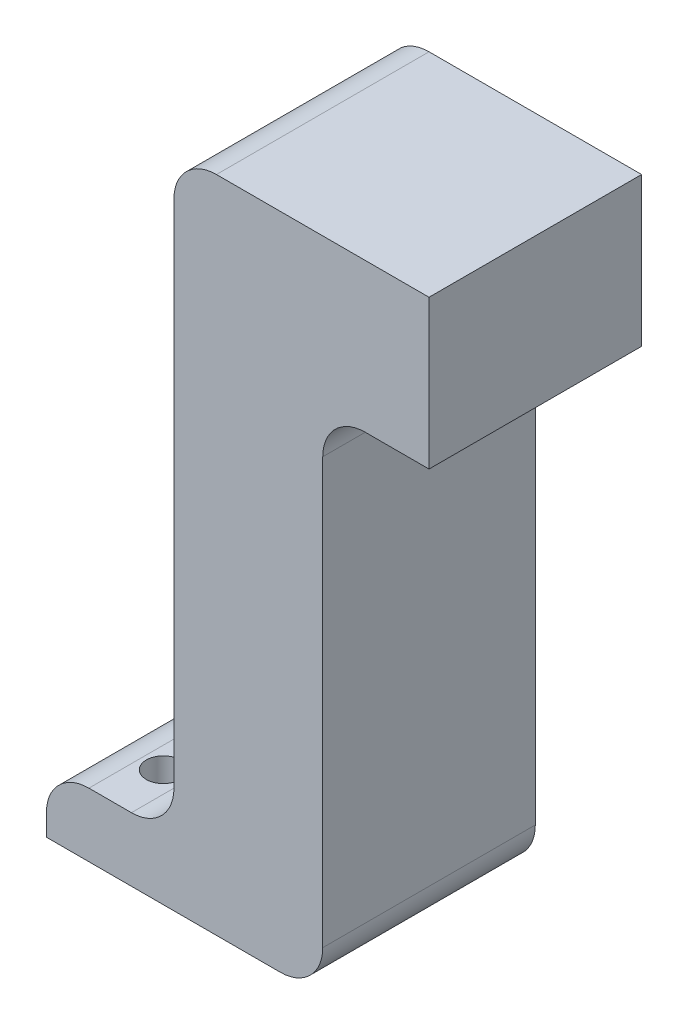
ISO-10303-21;
HEADER;
FILE_DESCRIPTION(('STEP AP214'),'2;1');
FILE_NAME('part.step','',(''),(''),'','','');
FILE_SCHEMA(('AUTOMOTIVE_DESIGN { 1 0 10303 214 1 1 1 1 }'));
ENDSEC;
DATA;
#1=APPLICATION_CONTEXT('core data for automotive mechanical design processes');
#2=APPLICATION_PROTOCOL_DEFINITION('international standard','automotive_design',2000,#1);
#3=PRODUCT_CONTEXT('',#1,'mechanical');
#4=PRODUCT('Part','Part','',(#3));
#5=PRODUCT_RELATED_PRODUCT_CATEGORY('part','',(#4));
#6=PRODUCT_DEFINITION_FORMATION('','',#4);
#7=PRODUCT_DEFINITION_CONTEXT('part definition',#1,'design');
#8=PRODUCT_DEFINITION('design','',#6,#7);
#9=PRODUCT_DEFINITION_SHAPE('','',#8);
#10=(LENGTH_UNIT() NAMED_UNIT(*) SI_UNIT(.MILLI.,.METRE.));
#11=(NAMED_UNIT(*) PLANE_ANGLE_UNIT() SI_UNIT($,.RADIAN.));
#12=(NAMED_UNIT(*) SI_UNIT($,.STERADIAN.) SOLID_ANGLE_UNIT());
#13=UNCERTAINTY_MEASURE_WITH_UNIT(LENGTH_MEASURE(1.E-05),#10,'distance_accuracy_value','');
#14=(GEOMETRIC_REPRESENTATION_CONTEXT(3) GLOBAL_UNCERTAINTY_ASSIGNED_CONTEXT((#13)) GLOBAL_UNIT_ASSIGNED_CONTEXT((#10,
#11,#12)) REPRESENTATION_CONTEXT('',''));
#15=CARTESIAN_POINT('',(0.,0.,0.));
#16=DIRECTION('',(0.,0.,1.));
#17=DIRECTION('',(1.,0.,0.));
#18=AXIS2_PLACEMENT_3D('',#15,#16,#17);
#19=CARTESIAN_POINT('',(0.,2.,-0.625));
#20=DIRECTION('',(0.,-1.,0.));
#21=DIRECTION('',(0.,0.,-1.));
#22=AXIS2_PLACEMENT_3D('',#19,#20,#21);
#23=PLANE('',#22);
#24=DIRECTION('',(1.,0.,0.));
#25=VECTOR('',#24,1.);
#26=CARTESIAN_POINT('',(0.,2.,-0.625));
#27=LINE('',#26,#25);
#28=CARTESIAN_POINT('',(-0.964230564727712,2.,-0.625));
#29=VERTEX_POINT('',#28);
#30=CARTESIAN_POINT('',(1.53576943527229,2.,-0.625));
#31=VERTEX_POINT('',#30);
#32=EDGE_CURVE('E217',#29,#31,#27,.T.);
#33=ORIENTED_EDGE('',*,*,#32,.F.);
#34=DIRECTION('',(0.,0.,1.));
#35=VECTOR('',#34,1.);
#36=CARTESIAN_POINT('',(-0.964230564727712,2.,-0.625));
#37=LINE('',#36,#35);
#38=CARTESIAN_POINT('',(-0.964230564727712,2.,1.875));
#39=VERTEX_POINT('',#38);
#40=EDGE_CURVE('E276',#29,#39,#37,.T.);
#41=ORIENTED_EDGE('',*,*,#40,.T.);
#42=DIRECTION('',(1.,0.,0.));
#43=VECTOR('',#42,1.);
#44=CARTESIAN_POINT('',(0.,2.,1.875));
#45=LINE('',#44,#43);
#46=CARTESIAN_POINT('',(1.53576943527229,2.,1.875));
#47=VERTEX_POINT('',#46);
#48=EDGE_CURVE('E207',#39,#47,#45,.T.);
#49=ORIENTED_EDGE('',*,*,#48,.T.);
#50=DIRECTION('',(0.,0.,1.));
#51=VECTOR('',#50,1.);
#52=CARTESIAN_POINT('',(1.53576943527229,2.,-0.625));
#53=LINE('',#52,#51);
#54=EDGE_CURVE('E201',#31,#47,#53,.T.);
#55=ORIENTED_EDGE('',*,*,#54,.F.);
#56=EDGE_LOOP('',(#33,#41,#49,#55));
#57=FACE_BOUND('',#56,.T.);
#58=ADVANCED_FACE('F83',(#57),#23,.F.);
#59=CARTESIAN_POINT('',(-1.46423056472771,0.,-0.625));
#60=DIRECTION('',(1.,0.,0.));
#61=DIRECTION('',(0.,1.,0.));
#62=AXIS2_PLACEMENT_3D('',#59,#60,#61);
#63=PLANE('',#62);
#64=DIRECTION('',(0.,1.,0.));
#65=VECTOR('',#64,1.);
#66=CARTESIAN_POINT('',(-1.46423056472771,0.,-0.625));
#67=LINE('',#66,#65);
#68=CARTESIAN_POINT('',(-1.46423056472771,-4.5,-0.625));
#69=VERTEX_POINT('',#68);
#70=CARTESIAN_POINT('',(-1.46423056472771,1.5,-0.625));
#71=VERTEX_POINT('',#70);
#72=EDGE_CURVE('E202',#69,#71,#67,.T.);
#73=ORIENTED_EDGE('',*,*,#72,.F.);
#74=DIRECTION('',(0.,0.,1.));
#75=VECTOR('',#74,1.);
#76=CARTESIAN_POINT('',(-1.46423056472771,-4.5,-0.625));
#77=LINE('',#76,#75);
#78=CARTESIAN_POINT('',(-1.46423056472771,-4.5,1.875));
#79=VERTEX_POINT('',#78);
#80=EDGE_CURVE('E271',#69,#79,#77,.T.);
#81=ORIENTED_EDGE('',*,*,#80,.T.);
#82=DIRECTION('',(0.,1.,0.));
#83=VECTOR('',#82,1.);
#84=CARTESIAN_POINT('',(-1.46423056472771,0.,1.875));
#85=LINE('',#84,#83);
#86=CARTESIAN_POINT('',(-1.46423056472771,1.5,1.875));
#87=VERTEX_POINT('',#86);
#88=EDGE_CURVE('E209',#79,#87,#85,.T.);
#89=ORIENTED_EDGE('',*,*,#88,.T.);
#90=DIRECTION('',(0.,0.,1.));
#91=VECTOR('',#90,1.);
#92=CARTESIAN_POINT('',(-1.46423056472771,1.5,-0.625));
#93=LINE('',#92,#91);
#94=EDGE_CURVE('E106',#87,#71,#93,.F.);
#95=ORIENTED_EDGE('',*,*,#94,.T.);
#96=EDGE_LOOP('',(#73,#81,#89,#95));
#97=FACE_BOUND('',#96,.T.);
#98=ADVANCED_FACE('F302',(#97),#63,.F.);
#99=CARTESIAN_POINT('',(1.53576943527229,0.,-0.625));
#100=DIRECTION('',(1.,0.,0.));
#101=DIRECTION('',(0.,0.,-1.));
#102=AXIS2_PLACEMENT_3D('',#99,#100,#101);
#103=PLANE('',#102);
#104=ORIENTED_EDGE('',*,*,#54,.T.);
#105=DIRECTION('',(0.,1.,0.));
#106=VECTOR('',#105,1.);
#107=CARTESIAN_POINT('',(1.53576943527229,0.,1.875));
#108=LINE('',#107,#106);
#109=CARTESIAN_POINT('',(1.53576943527229,0.25,1.875));
#110=VERTEX_POINT('',#109);
#111=EDGE_CURVE('E185',#110,#47,#108,.T.);
#112=ORIENTED_EDGE('',*,*,#111,.F.);
#113=DIRECTION('',(0.,0.,1.));
#114=VECTOR('',#113,1.);
#115=CARTESIAN_POINT('',(1.53576943527229,0.25,-0.625));
#116=LINE('',#115,#114);
#117=CARTESIAN_POINT('',(1.53576943527229,0.25,-0.625));
#118=VERTEX_POINT('',#117);
#119=EDGE_CURVE('E194',#118,#110,#116,.T.);
#120=ORIENTED_EDGE('',*,*,#119,.F.);
#121=DIRECTION('',(0.,1.,0.));
#122=VECTOR('',#121,1.);
#123=CARTESIAN_POINT('',(1.53576943527229,0.,-0.625));
#124=LINE('',#123,#122);
#125=EDGE_CURVE('E215',#118,#31,#124,.T.);
#126=ORIENTED_EDGE('',*,*,#125,.T.);
#127=EDGE_LOOP('',(#104,#112,#120,#126));
#128=FACE_BOUND('',#127,.T.);
#129=ADVANCED_FACE('F205',(#128),#103,.T.);
#130=CARTESIAN_POINT('',(0.,0.,-0.625));
#131=DIRECTION('',(0.,0.,1.));
#132=DIRECTION('',(1.,0.,0.));
#133=AXIS2_PLACEMENT_3D('',#130,#131,#132);
#134=PLANE('',#133);
#135=DIRECTION('',(0.,1.,0.));
#136=VECTOR('',#135,1.);
#137=CARTESIAN_POINT('',(-2.96423056472771,0.,-0.625));
#138=LINE('',#137,#136);
#139=CARTESIAN_POINT('',(-2.96423056472771,-5.75,-0.625));
#140=VERTEX_POINT('',#139);
#141=CARTESIAN_POINT('',(-2.96423056472771,-5.5,-0.625));
#142=VERTEX_POINT('',#141);
#143=EDGE_CURVE('E236',#140,#142,#138,.T.);
#144=ORIENTED_EDGE('',*,*,#143,.T.);
#145=CARTESIAN_POINT('',(-2.46423056472771,-5.5,-0.625));
#146=DIRECTION('',(0.,0.,1.));
#147=DIRECTION('',(1.,0.,0.));
#148=AXIS2_PLACEMENT_3D('',#145,#146,#147);
#149=CIRCLE('',#148,0.5);
#150=CARTESIAN_POINT('',(-2.46423056472771,-5.,-0.625));
#151=VERTEX_POINT('',#150);
#152=EDGE_CURVE('E261',#142,#151,#149,.F.);
#153=ORIENTED_EDGE('',*,*,#152,.T.);
#154=DIRECTION('',(-1.,0.,0.));
#155=VECTOR('',#154,1.);
#156=CARTESIAN_POINT('',(0.,-5.,-0.625));
#157=LINE('',#156,#155);
#158=CARTESIAN_POINT('',(-1.96423056472771,-5.,-0.625));
#159=VERTEX_POINT('',#158);
#160=EDGE_CURVE('E241',#159,#151,#157,.T.);
#161=ORIENTED_EDGE('',*,*,#160,.F.);
#162=CARTESIAN_POINT('',(-1.96423056472771,-4.5,-0.625));
#163=DIRECTION('',(0.,0.,1.));
#164=DIRECTION('',(1.,0.,0.));
#165=AXIS2_PLACEMENT_3D('',#162,#163,#164);
#166=CIRCLE('',#165,0.5);
#167=EDGE_CURVE('E281',#159,#69,#166,.T.);
#168=ORIENTED_EDGE('',*,*,#167,.T.);
#169=ORIENTED_EDGE('',*,*,#72,.T.);
#170=CARTESIAN_POINT('',(-0.964230564727712,1.5,-0.625));
#171=DIRECTION('',(0.,0.,1.));
#172=DIRECTION('',(1.,0.,0.));
#173=AXIS2_PLACEMENT_3D('',#170,#171,#172);
#174=CIRCLE('',#173,0.5);
#175=EDGE_CURVE('E98',#71,#29,#174,.F.);
#176=ORIENTED_EDGE('',*,*,#175,.T.);
#177=ORIENTED_EDGE('',*,*,#32,.T.);
#178=ORIENTED_EDGE('',*,*,#125,.F.);
#179=DIRECTION('',(1.,0.,0.));
#180=VECTOR('',#179,1.);
#181=CARTESIAN_POINT('',(0.,0.25,-0.625));
#182=LINE('',#181,#180);
#183=CARTESIAN_POINT('',(0.785769435272288,0.25,-0.625));
#184=VERTEX_POINT('',#183);
#185=EDGE_CURVE('E197',#184,#118,#182,.T.);
#186=ORIENTED_EDGE('',*,*,#185,.F.);
#187=CARTESIAN_POINT('',(0.785769435272288,-0.25,-0.625));
#188=DIRECTION('',(0.,0.,1.));
#189=DIRECTION('',(1.,0.,0.));
#190=AXIS2_PLACEMENT_3D('',#187,#188,#189);
#191=CIRCLE('',#190,0.5);
#192=CARTESIAN_POINT('',(0.285769435272288,-0.25,-0.625));
#193=VERTEX_POINT('',#192);
#194=EDGE_CURVE('E91',#184,#193,#191,.T.);
#195=ORIENTED_EDGE('',*,*,#194,.T.);
#196=DIRECTION('',(0.,-1.,0.));
#197=VECTOR('',#196,1.);
#198=CARTESIAN_POINT('',(0.285769435272288,0.25,-0.625));
#199=LINE('',#198,#197);
#200=CARTESIAN_POINT('',(0.285769435272291,-5.25,-0.625));
#201=VERTEX_POINT('',#200);
#202=EDGE_CURVE('E222',#193,#201,#199,.T.);
#203=ORIENTED_EDGE('',*,*,#202,.T.);
#204=CARTESIAN_POINT('',(-0.214230564727709,-5.25,-0.625));
#205=DIRECTION('',(0.,0.,1.));
#206=DIRECTION('',(1.,0.,0.));
#207=AXIS2_PLACEMENT_3D('',#204,#205,#206);
#208=CIRCLE('',#207,0.5);
#209=CARTESIAN_POINT('',(-0.214230564727709,-5.75,-0.625));
#210=VERTEX_POINT('',#209);
#211=EDGE_CURVE('E259',#201,#210,#208,.F.);
#212=ORIENTED_EDGE('',*,*,#211,.T.);
#213=DIRECTION('',(-1.,0.,0.));
#214=VECTOR('',#213,1.);
#215=CARTESIAN_POINT('',(0.,-5.75,-0.625));
#216=LINE('',#215,#214);
#217=EDGE_CURVE('E239',#210,#140,#216,.T.);
#218=ORIENTED_EDGE('',*,*,#217,.T.);
#219=EDGE_LOOP('',(#144,#153,#161,#168,#169,#176,#177,#178,#186,#195,#203,#212,#218));
#220=FACE_BOUND('',#219,.T.);
#221=ADVANCED_FACE('F283',(#220),#134,.F.);
#222=CARTESIAN_POINT('',(0.,0.,1.875));
#223=DIRECTION('',(0.,0.,1.));
#224=DIRECTION('',(1.,0.,0.));
#225=AXIS2_PLACEMENT_3D('',#222,#223,#224);
#226=PLANE('',#225);
#227=DIRECTION('',(-1.,0.,0.));
#228=VECTOR('',#227,1.);
#229=CARTESIAN_POINT('',(0.,-5.,1.875));
#230=LINE('',#229,#228);
#231=CARTESIAN_POINT('',(-1.96423056472771,-5.,1.875));
#232=VERTEX_POINT('',#231);
#233=CARTESIAN_POINT('',(-2.46423056472771,-5.,1.875));
#234=VERTEX_POINT('',#233);
#235=EDGE_CURVE('E234',#232,#234,#230,.T.);
#236=ORIENTED_EDGE('',*,*,#235,.T.);
#237=CARTESIAN_POINT('',(-2.46423056472771,-5.5,1.875));
#238=DIRECTION('',(0.,0.,1.));
#239=DIRECTION('',(1.,0.,0.));
#240=AXIS2_PLACEMENT_3D('',#237,#238,#239);
#241=CIRCLE('',#240,0.5);
#242=CARTESIAN_POINT('',(-2.96423056472771,-5.5,1.875));
#243=VERTEX_POINT('',#242);
#244=EDGE_CURVE('E254',#234,#243,#241,.T.);
#245=ORIENTED_EDGE('',*,*,#244,.T.);
#246=DIRECTION('',(0.,1.,0.));
#247=VECTOR('',#246,1.);
#248=CARTESIAN_POINT('',(-2.96423056472771,0.,1.875));
#249=LINE('',#248,#247);
#250=CARTESIAN_POINT('',(-2.96423056472771,-5.75,1.875));
#251=VERTEX_POINT('',#250);
#252=EDGE_CURVE('E229',#251,#243,#249,.T.);
#253=ORIENTED_EDGE('',*,*,#252,.F.);
#254=DIRECTION('',(-1.,0.,0.));
#255=VECTOR('',#254,1.);
#256=CARTESIAN_POINT('',(0.,-5.75,1.875));
#257=LINE('',#256,#255);
#258=CARTESIAN_POINT('',(-0.214230564727709,-5.75,1.875));
#259=VERTEX_POINT('',#258);
#260=EDGE_CURVE('E232',#259,#251,#257,.T.);
#261=ORIENTED_EDGE('',*,*,#260,.F.);
#262=CARTESIAN_POINT('',(-0.214230564727709,-5.25,1.875));
#263=DIRECTION('',(0.,0.,1.));
#264=DIRECTION('',(1.,0.,0.));
#265=AXIS2_PLACEMENT_3D('',#262,#263,#264);
#266=CIRCLE('',#265,0.5);
#267=CARTESIAN_POINT('',(0.285769435272291,-5.25,1.875));
#268=VERTEX_POINT('',#267);
#269=EDGE_CURVE('E252',#259,#268,#266,.T.);
#270=ORIENTED_EDGE('',*,*,#269,.T.);
#271=DIRECTION('',(0.,-1.,0.));
#272=VECTOR('',#271,1.);
#273=CARTESIAN_POINT('',(0.285769435272288,0.25,1.875));
#274=LINE('',#273,#272);
#275=CARTESIAN_POINT('',(0.285769435272288,-0.25,1.875));
#276=VERTEX_POINT('',#275);
#277=EDGE_CURVE('E225',#276,#268,#274,.T.);
#278=ORIENTED_EDGE('',*,*,#277,.F.);
#279=CARTESIAN_POINT('',(0.785769435272288,-0.25,1.875));
#280=DIRECTION('',(0.,0.,1.));
#281=DIRECTION('',(1.,0.,0.));
#282=AXIS2_PLACEMENT_3D('',#279,#280,#281);
#283=CIRCLE('',#282,0.5);
#284=CARTESIAN_POINT('',(0.785769435272288,0.25,1.875));
#285=VERTEX_POINT('',#284);
#286=EDGE_CURVE('E12',#276,#285,#283,.F.);
#287=ORIENTED_EDGE('',*,*,#286,.T.);
#288=DIRECTION('',(1.,0.,0.));
#289=VECTOR('',#288,1.);
#290=CARTESIAN_POINT('',(0.,0.25,1.875));
#291=LINE('',#290,#289);
#292=EDGE_CURVE('E179',#285,#110,#291,.T.);
#293=ORIENTED_EDGE('',*,*,#292,.T.);
#294=ORIENTED_EDGE('',*,*,#111,.T.);
#295=ORIENTED_EDGE('',*,*,#48,.F.);
#296=CARTESIAN_POINT('',(-0.964230564727712,1.5,1.875));
#297=DIRECTION('',(0.,0.,1.));
#298=DIRECTION('',(1.,0.,0.));
#299=AXIS2_PLACEMENT_3D('',#296,#297,#298);
#300=CIRCLE('',#299,0.5);
#301=EDGE_CURVE('E250',#39,#87,#300,.T.);
#302=ORIENTED_EDGE('',*,*,#301,.T.);
#303=ORIENTED_EDGE('',*,*,#88,.F.);
#304=CARTESIAN_POINT('',(-1.96423056472771,-4.5,1.875));
#305=DIRECTION('',(0.,0.,1.));
#306=DIRECTION('',(1.,0.,0.));
#307=AXIS2_PLACEMENT_3D('',#304,#305,#306);
#308=CIRCLE('',#307,0.5);
#309=EDGE_CURVE('E279',#79,#232,#308,.F.);
#310=ORIENTED_EDGE('',*,*,#309,.T.);
#311=EDGE_LOOP('',(#236,#245,#253,#261,#270,#278,#287,#293,#294,#295,#302,#303,#310));
#312=FACE_BOUND('',#311,.T.);
#313=ADVANCED_FACE('F182',(#312),#226,.T.);
#314=CARTESIAN_POINT('',(0.,0.25,-0.625));
#315=DIRECTION('',(0.,-1.,0.));
#316=DIRECTION('',(0.,0.,-1.));
#317=AXIS2_PLACEMENT_3D('',#314,#315,#316);
#318=PLANE('',#317);
#319=ORIENTED_EDGE('',*,*,#292,.F.);
#320=DIRECTION('',(0.,0.,-1.));
#321=VECTOR('',#320,1.);
#322=CARTESIAN_POINT('',(0.785769435272288,0.25,-0.625));
#323=LINE('',#322,#321);
#324=EDGE_CURVE('E274',#285,#184,#323,.T.);
#325=ORIENTED_EDGE('',*,*,#324,.T.);
#326=ORIENTED_EDGE('',*,*,#185,.T.);
#327=ORIENTED_EDGE('',*,*,#119,.T.);
#328=EDGE_LOOP('',(#319,#325,#326,#327));
#329=FACE_BOUND('',#328,.T.);
#330=ADVANCED_FACE('F195',(#329),#318,.T.);
#331=CARTESIAN_POINT('',(0.,-5.,-0.625));
#332=DIRECTION('',(0.,1.,0.));
#333=DIRECTION('',(0.,0.,1.));
#334=AXIS2_PLACEMENT_3D('',#331,#332,#333);
#335=PLANE('',#334);
#336=CARTESIAN_POINT('',(-2.21423056472771,-5.,0.));
#337=DIRECTION('',(0.,1.,0.));
#338=DIRECTION('',(0.,0.,1.));
#339=AXIS2_PLACEMENT_3D('',#336,#337,#338);
#340=CIRCLE('',#339,0.2);
#341=CARTESIAN_POINT('',(-2.21423056472771,-5.,0.2));
#342=VERTEX_POINT('',#341);
#343=EDGE_CURVE('E477',#342,#342,#340,.T.);
#344=ORIENTED_EDGE('',*,*,#343,.F.);
#345=EDGE_LOOP('',(#344));
#346=FACE_BOUND('',#345,.T.);
#347=CARTESIAN_POINT('',(-2.21423056472771,-5.,1.25));
#348=DIRECTION('',(0.,1.,0.));
#349=DIRECTION('',(0.,0.,1.));
#350=AXIS2_PLACEMENT_3D('',#347,#348,#349);
#351=CIRCLE('',#350,0.2);
#352=CARTESIAN_POINT('',(-2.21423056472771,-5.,1.45));
#353=VERTEX_POINT('',#352);
#354=EDGE_CURVE('E479',#353,#353,#351,.T.);
#355=ORIENTED_EDGE('',*,*,#354,.F.);
#356=EDGE_LOOP('',(#355));
#357=FACE_BOUND('',#356,.T.);
#358=ORIENTED_EDGE('',*,*,#160,.T.);
#359=DIRECTION('',(0.,0.,1.));
#360=VECTOR('',#359,1.);
#361=CARTESIAN_POINT('',(-2.46423056472771,-5.,1.875));
#362=LINE('',#361,#360);
#363=EDGE_CURVE('E247',#151,#234,#362,.T.);
#364=ORIENTED_EDGE('',*,*,#363,.T.);
#365=ORIENTED_EDGE('',*,*,#235,.F.);
#366=DIRECTION('',(0.,0.,1.));
#367=VECTOR('',#366,1.);
#368=CARTESIAN_POINT('',(-1.96423056472771,-5.,-0.625));
#369=LINE('',#368,#367);
#370=EDGE_CURVE('E220',#232,#159,#369,.F.);
#371=ORIENTED_EDGE('',*,*,#370,.T.);
#372=EDGE_LOOP('',(#358,#364,#365,#371));
#373=FACE_BOUND('',#372,.T.);
#374=ADVANCED_FACE('F315',(#346,#357,#373),#335,.T.);
#375=CARTESIAN_POINT('',(-2.96423056472771,0.,-0.625));
#376=DIRECTION('',(1.,0.,0.));
#377=DIRECTION('',(0.,1.,0.));
#378=AXIS2_PLACEMENT_3D('',#375,#376,#377);
#379=PLANE('',#378);
#380=ORIENTED_EDGE('',*,*,#252,.T.);
#381=DIRECTION('',(0.,0.,1.));
#382=VECTOR('',#381,1.);
#383=CARTESIAN_POINT('',(-2.96423056472771,-5.5,-0.625));
#384=LINE('',#383,#382);
#385=EDGE_CURVE('E256',#243,#142,#384,.F.);
#386=ORIENTED_EDGE('',*,*,#385,.T.);
#387=ORIENTED_EDGE('',*,*,#143,.F.);
#388=DIRECTION('',(0.,0.,1.));
#389=VECTOR('',#388,1.);
#390=CARTESIAN_POINT('',(-2.96423056472771,-5.75,-0.625));
#391=LINE('',#390,#389);
#392=EDGE_CURVE('E191',#140,#251,#391,.T.);
#393=ORIENTED_EDGE('',*,*,#392,.T.);
#394=EDGE_LOOP('',(#380,#386,#387,#393));
#395=FACE_BOUND('',#394,.T.);
#396=ADVANCED_FACE('F320',(#395),#379,.F.);
#397=CARTESIAN_POINT('',(0.,-5.75,-0.625));
#398=DIRECTION('',(0.,1.,0.));
#399=DIRECTION('',(0.,0.,1.));
#400=AXIS2_PLACEMENT_3D('',#397,#398,#399);
#401=PLANE('',#400);
#402=CARTESIAN_POINT('',(-2.21423056472771,-5.75,0.));
#403=DIRECTION('',(0.,1.,0.));
#404=DIRECTION('',(0.,0.,1.));
#405=AXIS2_PLACEMENT_3D('',#402,#403,#404);
#406=CIRCLE('',#405,0.2);
#407=CARTESIAN_POINT('',(-2.21423056472771,-5.75,0.2));
#408=VERTEX_POINT('',#407);
#409=EDGE_CURVE('E474',#408,#408,#406,.T.);
#410=ORIENTED_EDGE('',*,*,#409,.T.);
#411=EDGE_LOOP('',(#410));
#412=FACE_BOUND('',#411,.T.);
#413=CARTESIAN_POINT('',(-2.21423056472771,-5.75,1.25));
#414=DIRECTION('',(0.,1.,0.));
#415=DIRECTION('',(0.,0.,1.));
#416=AXIS2_PLACEMENT_3D('',#413,#414,#415);
#417=CIRCLE('',#416,0.2);
#418=CARTESIAN_POINT('',(-2.21423056472771,-5.75,1.45));
#419=VERTEX_POINT('',#418);
#420=EDGE_CURVE('E226',#419,#419,#417,.T.);
#421=ORIENTED_EDGE('',*,*,#420,.T.);
#422=EDGE_LOOP('',(#421));
#423=FACE_BOUND('',#422,.T.);
#424=ORIENTED_EDGE('',*,*,#217,.F.);
#425=DIRECTION('',(0.,0.,-1.));
#426=VECTOR('',#425,1.);
#427=CARTESIAN_POINT('',(-0.214230564727709,-5.75,1.875));
#428=LINE('',#427,#426);
#429=EDGE_CURVE('E268',#210,#259,#428,.F.);
#430=ORIENTED_EDGE('',*,*,#429,.T.);
#431=ORIENTED_EDGE('',*,*,#260,.T.);
#432=ORIENTED_EDGE('',*,*,#392,.F.);
#433=EDGE_LOOP('',(#424,#430,#431,#432));
#434=FACE_BOUND('',#433,.T.);
#435=ADVANCED_FACE('F319',(#412,#423,#434),#401,.F.);
#436=CARTESIAN_POINT('',(0.285769435272288,0.25,1.875));
#437=DIRECTION('',(1.,0.,0.));
#438=DIRECTION('',(0.,1.,0.));
#439=AXIS2_PLACEMENT_3D('',#436,#437,#438);
#440=PLANE('',#439);
#441=ORIENTED_EDGE('',*,*,#277,.T.);
#442=DIRECTION('',(0.,0.,-1.));
#443=VECTOR('',#442,1.);
#444=CARTESIAN_POINT('',(0.285769435272291,-5.25,-0.625));
#445=LINE('',#444,#443);
#446=EDGE_CURVE('E265',#268,#201,#445,.T.);
#447=ORIENTED_EDGE('',*,*,#446,.T.);
#448=ORIENTED_EDGE('',*,*,#202,.F.);
#449=DIRECTION('',(0.,0.,-1.));
#450=VECTOR('',#449,1.);
#451=CARTESIAN_POINT('',(0.285769435272288,-0.25,1.875));
#452=LINE('',#451,#450);
#453=EDGE_CURVE('E263',#193,#276,#452,.F.);
#454=ORIENTED_EDGE('',*,*,#453,.T.);
#455=EDGE_LOOP('',(#441,#447,#448,#454));
#456=FACE_BOUND('',#455,.T.);
#457=ADVANCED_FACE('F287',(#456),#440,.T.);
#458=CARTESIAN_POINT('',(-2.46423056472771,-5.5,-0.625));
#459=DIRECTION('',(0.,0.,-1.));
#460=DIRECTION('',(-1.,0.,0.));
#461=AXIS2_PLACEMENT_3D('',#458,#459,#460);
#462=CYLINDRICAL_SURFACE('',#461,0.5);
#463=ORIENTED_EDGE('',*,*,#152,.F.);
#464=ORIENTED_EDGE('',*,*,#385,.F.);
#465=ORIENTED_EDGE('',*,*,#244,.F.);
#466=ORIENTED_EDGE('',*,*,#363,.F.);
#467=EDGE_LOOP('',(#463,#464,#465,#466));
#468=FACE_BOUND('',#467,.T.);
#469=ADVANCED_FACE('F318',(#468),#462,.T.);
#470=CARTESIAN_POINT('',(-0.214230564727709,-5.25,1.875));
#471=DIRECTION('',(0.,0.,1.));
#472=DIRECTION('',(1.,0.,0.));
#473=AXIS2_PLACEMENT_3D('',#470,#471,#472);
#474=CYLINDRICAL_SURFACE('',#473,0.5);
#475=ORIENTED_EDGE('',*,*,#269,.F.);
#476=ORIENTED_EDGE('',*,*,#429,.F.);
#477=ORIENTED_EDGE('',*,*,#211,.F.);
#478=ORIENTED_EDGE('',*,*,#446,.F.);
#479=EDGE_LOOP('',(#475,#476,#477,#478));
#480=FACE_BOUND('',#479,.T.);
#481=ADVANCED_FACE('F298',(#480),#474,.T.);
#482=CARTESIAN_POINT('',(-1.96423056472771,-4.5,-0.625));
#483=DIRECTION('',(0.,0.,1.));
#484=DIRECTION('',(1.,0.,0.));
#485=AXIS2_PLACEMENT_3D('',#482,#483,#484);
#486=CYLINDRICAL_SURFACE('',#485,0.5);
#487=ORIENTED_EDGE('',*,*,#167,.F.);
#488=ORIENTED_EDGE('',*,*,#370,.F.);
#489=ORIENTED_EDGE('',*,*,#309,.F.);
#490=ORIENTED_EDGE('',*,*,#80,.F.);
#491=EDGE_LOOP('',(#487,#488,#489,#490));
#492=FACE_BOUND('',#491,.T.);
#493=ADVANCED_FACE('F291',(#492),#486,.F.);
#494=CARTESIAN_POINT('',(0.785769435272288,-0.25,-0.625));
#495=DIRECTION('',(0.,0.,1.));
#496=DIRECTION('',(1.,0.,0.));
#497=AXIS2_PLACEMENT_3D('',#494,#495,#496);
#498=CYLINDRICAL_SURFACE('',#497,0.5);
#499=ORIENTED_EDGE('',*,*,#286,.F.);
#500=ORIENTED_EDGE('',*,*,#453,.F.);
#501=ORIENTED_EDGE('',*,*,#194,.F.);
#502=ORIENTED_EDGE('',*,*,#324,.F.);
#503=EDGE_LOOP('',(#499,#500,#501,#502));
#504=FACE_BOUND('',#503,.T.);
#505=ADVANCED_FACE('F289',(#504),#498,.F.);
#506=CARTESIAN_POINT('',(-0.964230564727712,1.5,-0.625));
#507=DIRECTION('',(0.,0.,1.));
#508=DIRECTION('',(1.,0.,0.));
#509=AXIS2_PLACEMENT_3D('',#506,#507,#508);
#510=CYLINDRICAL_SURFACE('',#509,0.5);
#511=ORIENTED_EDGE('',*,*,#175,.F.);
#512=ORIENTED_EDGE('',*,*,#94,.F.);
#513=ORIENTED_EDGE('',*,*,#301,.F.);
#514=ORIENTED_EDGE('',*,*,#40,.F.);
#515=EDGE_LOOP('',(#511,#512,#513,#514));
#516=FACE_BOUND('',#515,.T.);
#517=ADVANCED_FACE('F85',(#516),#510,.T.);
#518=CARTESIAN_POINT('',(-2.21423056472771,-5.,1.25));
#519=DIRECTION('',(0.,1.,0.));
#520=DIRECTION('',(0.,0.,1.));
#521=AXIS2_PLACEMENT_3D('',#518,#519,#520);
#522=CYLINDRICAL_SURFACE('',#521,0.2);
#523=ORIENTED_EDGE('',*,*,#420,.F.);
#524=EDGE_LOOP('',(#523));
#525=FACE_BOUND('',#524,.T.);
#526=ORIENTED_EDGE('',*,*,#354,.T.);
#527=EDGE_LOOP('',(#526));
#528=FACE_BOUND('',#527,.T.);
#529=ADVANCED_FACE('F296',(#525,#528),#522,.F.);
#530=CARTESIAN_POINT('',(-2.21423056472771,-5.,0.));
#531=DIRECTION('',(0.,1.,0.));
#532=DIRECTION('',(0.,0.,1.));
#533=AXIS2_PLACEMENT_3D('',#530,#531,#532);
#534=CYLINDRICAL_SURFACE('',#533,0.2);
#535=ORIENTED_EDGE('',*,*,#409,.F.);
#536=EDGE_LOOP('',(#535));
#537=FACE_BOUND('',#536,.T.);
#538=ORIENTED_EDGE('',*,*,#343,.T.);
#539=EDGE_LOOP('',(#538));
#540=FACE_BOUND('',#539,.T.);
#541=ADVANCED_FACE('F397',(#537,#540),#534,.F.);
#542=CLOSED_SHELL('',(#58,#98,#129,#221,#313,#330,#374,#396,#435,#457,#469,#481,#493,#505,#517,
#529,#541));
#543=MANIFOLD_SOLID_BREP('B2',#542);
#544=ADVANCED_BREP_SHAPE_REPRESENTATION('',(#18,#543),#14);
#545=SHAPE_DEFINITION_REPRESENTATION(#9,#544);
ENDSEC;
END-ISO-10303-21;
